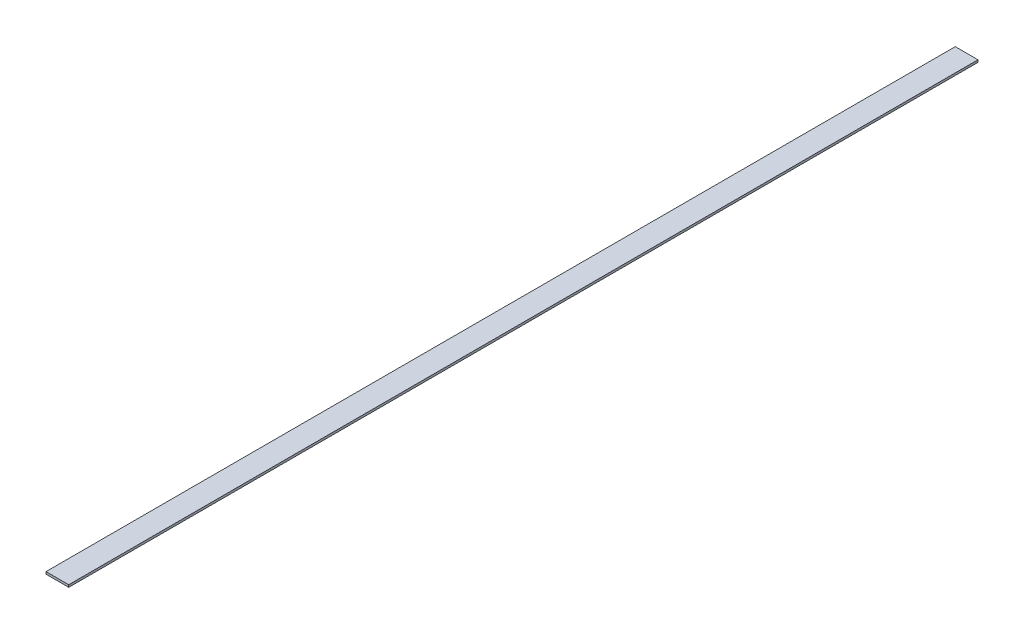
ISO-10303-21;
HEADER;
FILE_DESCRIPTION(('STEP AP214'),'2;1');
FILE_NAME('part.step','',(''),(''),'','','');
FILE_SCHEMA(('AUTOMOTIVE_DESIGN { 1 0 10303 214 1 1 1 1 }'));
ENDSEC;
DATA;
#1=APPLICATION_CONTEXT('core data for automotive mechanical design processes');
#2=APPLICATION_PROTOCOL_DEFINITION('international standard','automotive_design',2000,#1);
#3=PRODUCT_CONTEXT('',#1,'mechanical');
#4=PRODUCT('Part','Part','',(#3));
#5=PRODUCT_RELATED_PRODUCT_CATEGORY('part','',(#4));
#6=PRODUCT_DEFINITION_FORMATION('','',#4);
#7=PRODUCT_DEFINITION_CONTEXT('part definition',#1,'design');
#8=PRODUCT_DEFINITION('design','',#6,#7);
#9=PRODUCT_DEFINITION_SHAPE('','',#8);
#10=(LENGTH_UNIT() NAMED_UNIT(*) SI_UNIT(.MILLI.,.METRE.));
#11=(NAMED_UNIT(*) PLANE_ANGLE_UNIT() SI_UNIT($,.RADIAN.));
#12=(NAMED_UNIT(*) SI_UNIT($,.STERADIAN.) SOLID_ANGLE_UNIT());
#13=UNCERTAINTY_MEASURE_WITH_UNIT(LENGTH_MEASURE(1.E-05),#10,'distance_accuracy_value','');
#14=(GEOMETRIC_REPRESENTATION_CONTEXT(3) GLOBAL_UNCERTAINTY_ASSIGNED_CONTEXT((#13)) GLOBAL_UNIT_ASSIGNED_CONTEXT((#10,
#11,#12)) REPRESENTATION_CONTEXT('',''));
#15=CARTESIAN_POINT('',(0.,0.,0.));
#16=DIRECTION('',(0.,0.,1.));
#17=DIRECTION('',(1.,0.,0.));
#18=AXIS2_PLACEMENT_3D('',#15,#16,#17);
#19=CARTESIAN_POINT('',(15.,1.5,1200.));
#20=DIRECTION('',(-1.,0.,0.));
#21=DIRECTION('',(0.,-1.,0.));
#22=AXIS2_PLACEMENT_3D('',#19,#20,#21);
#23=PLANE('',#22);
#24=DIRECTION('',(0.,1.,0.));
#25=VECTOR('',#24,1.);
#26=CARTESIAN_POINT('',(15.,1.5,0.));
#27=LINE('',#26,#25);
#28=CARTESIAN_POINT('',(15.,-1.5,0.));
#29=VERTEX_POINT('',#28);
#30=CARTESIAN_POINT('',(15.,1.5,0.));
#31=VERTEX_POINT('',#30);
#32=EDGE_CURVE('E111',#29,#31,#27,.T.);
#33=ORIENTED_EDGE('',*,*,#32,.T.);
#34=DIRECTION('',(0.,0.,-1.));
#35=VECTOR('',#34,1.);
#36=CARTESIAN_POINT('',(15.,1.5,1200.));
#37=LINE('',#36,#35);
#38=CARTESIAN_POINT('',(15.,1.5,1200.));
#39=VERTEX_POINT('',#38);
#40=EDGE_CURVE('E11',#39,#31,#37,.T.);
#41=ORIENTED_EDGE('',*,*,#40,.F.);
#42=DIRECTION('',(0.,1.,0.));
#43=VECTOR('',#42,1.);
#44=CARTESIAN_POINT('',(15.,1.5,1200.));
#45=LINE('',#44,#43);
#46=CARTESIAN_POINT('',(15.,-1.5,1200.));
#47=VERTEX_POINT('',#46);
#48=EDGE_CURVE('E95',#47,#39,#45,.T.);
#49=ORIENTED_EDGE('',*,*,#48,.F.);
#50=DIRECTION('',(0.,0.,-1.));
#51=VECTOR('',#50,1.);
#52=CARTESIAN_POINT('',(15.,-1.5,1200.));
#53=LINE('',#52,#51);
#54=EDGE_CURVE('E107',#47,#29,#53,.T.);
#55=ORIENTED_EDGE('',*,*,#54,.T.);
#56=EDGE_LOOP('',(#33,#41,#49,#55));
#57=FACE_BOUND('',#56,.T.);
#58=ADVANCED_FACE('F43',(#57),#23,.F.);
#59=CARTESIAN_POINT('',(-15.,1.5,1200.));
#60=DIRECTION('',(0.,-1.,0.));
#61=DIRECTION('',(0.,0.,-1.));
#62=AXIS2_PLACEMENT_3D('',#59,#60,#61);
#63=PLANE('',#62);
#64=DIRECTION('',(-1.,0.,0.));
#65=VECTOR('',#64,1.);
#66=CARTESIAN_POINT('',(-15.,1.5,0.));
#67=LINE('',#66,#65);
#68=CARTESIAN_POINT('',(-15.,1.5,0.));
#69=VERTEX_POINT('',#68);
#70=EDGE_CURVE('E100',#31,#69,#67,.T.);
#71=ORIENTED_EDGE('',*,*,#70,.T.);
#72=DIRECTION('',(0.,0.,-1.));
#73=VECTOR('',#72,1.);
#74=CARTESIAN_POINT('',(-15.,1.5,1200.));
#75=LINE('',#74,#73);
#76=CARTESIAN_POINT('',(-15.,1.5,1200.));
#77=VERTEX_POINT('',#76);
#78=EDGE_CURVE('E52',#77,#69,#75,.T.);
#79=ORIENTED_EDGE('',*,*,#78,.F.);
#80=DIRECTION('',(-1.,0.,0.));
#81=VECTOR('',#80,1.);
#82=CARTESIAN_POINT('',(-15.,1.5,1200.));
#83=LINE('',#82,#81);
#84=EDGE_CURVE('E90',#39,#77,#83,.T.);
#85=ORIENTED_EDGE('',*,*,#84,.F.);
#86=ORIENTED_EDGE('',*,*,#40,.T.);
#87=EDGE_LOOP('',(#71,#79,#85,#86));
#88=FACE_BOUND('',#87,.T.);
#89=ADVANCED_FACE('F99',(#88),#63,.F.);
#90=CARTESIAN_POINT('',(-15.,1.5,1200.));
#91=DIRECTION('',(1.,0.,0.));
#92=DIRECTION('',(0.,0.,-1.));
#93=AXIS2_PLACEMENT_3D('',#90,#91,#92);
#94=PLANE('',#93);
#95=DIRECTION('',(0.,-1.,0.));
#96=VECTOR('',#95,1.);
#97=CARTESIAN_POINT('',(-15.,1.5,0.));
#98=LINE('',#97,#96);
#99=CARTESIAN_POINT('',(-15.,-1.5,0.));
#100=VERTEX_POINT('',#99);
#101=EDGE_CURVE('E77',#69,#100,#98,.T.);
#102=ORIENTED_EDGE('',*,*,#101,.T.);
#103=DIRECTION('',(0.,0.,-1.));
#104=VECTOR('',#103,1.);
#105=CARTESIAN_POINT('',(-15.,-1.5,1200.));
#106=LINE('',#105,#104);
#107=CARTESIAN_POINT('',(-15.,-1.5,1200.));
#108=VERTEX_POINT('',#107);
#109=EDGE_CURVE('E102',#108,#100,#106,.T.);
#110=ORIENTED_EDGE('',*,*,#109,.F.);
#111=DIRECTION('',(0.,-1.,0.));
#112=VECTOR('',#111,1.);
#113=CARTESIAN_POINT('',(-15.,1.5,1200.));
#114=LINE('',#113,#112);
#115=EDGE_CURVE('E93',#77,#108,#114,.T.);
#116=ORIENTED_EDGE('',*,*,#115,.F.);
#117=ORIENTED_EDGE('',*,*,#78,.T.);
#118=EDGE_LOOP('',(#102,#110,#116,#117));
#119=FACE_BOUND('',#118,.T.);
#120=ADVANCED_FACE('F103',(#119),#94,.F.);
#121=CARTESIAN_POINT('',(-15.,-1.5,1200.));
#122=DIRECTION('',(0.,1.,0.));
#123=DIRECTION('',(0.,0.,1.));
#124=AXIS2_PLACEMENT_3D('',#121,#122,#123);
#125=PLANE('',#124);
#126=DIRECTION('',(1.,0.,0.));
#127=VECTOR('',#126,1.);
#128=CARTESIAN_POINT('',(-15.,-1.5,0.));
#129=LINE('',#128,#127);
#130=EDGE_CURVE('E83',#100,#29,#129,.T.);
#131=ORIENTED_EDGE('',*,*,#130,.T.);
#132=ORIENTED_EDGE('',*,*,#54,.F.);
#133=DIRECTION('',(1.,0.,0.));
#134=VECTOR('',#133,1.);
#135=CARTESIAN_POINT('',(-15.,-1.5,1200.));
#136=LINE('',#135,#134);
#137=EDGE_CURVE('E60',#108,#47,#136,.T.);
#138=ORIENTED_EDGE('',*,*,#137,.F.);
#139=ORIENTED_EDGE('',*,*,#109,.T.);
#140=EDGE_LOOP('',(#131,#132,#138,#139));
#141=FACE_BOUND('',#140,.T.);
#142=ADVANCED_FACE('F124',(#141),#125,.F.);
#143=CARTESIAN_POINT('',(0.,0.,1200.));
#144=DIRECTION('',(0.,0.,1.));
#145=DIRECTION('',(1.,0.,0.));
#146=AXIS2_PLACEMENT_3D('',#143,#144,#145);
#147=PLANE('',#146);
#148=ORIENTED_EDGE('',*,*,#48,.T.);
#149=ORIENTED_EDGE('',*,*,#84,.T.);
#150=ORIENTED_EDGE('',*,*,#115,.T.);
#151=ORIENTED_EDGE('',*,*,#137,.T.);
#152=EDGE_LOOP('',(#148,#149,#150,#151));
#153=FACE_BOUND('',#152,.T.);
#154=ADVANCED_FACE('F91',(#153),#147,.T.);
#155=CARTESIAN_POINT('',(0.,0.,0.));
#156=DIRECTION('',(0.,0.,1.));
#157=DIRECTION('',(1.,0.,0.));
#158=AXIS2_PLACEMENT_3D('',#155,#156,#157);
#159=PLANE('',#158);
#160=ORIENTED_EDGE('',*,*,#32,.F.);
#161=ORIENTED_EDGE('',*,*,#130,.F.);
#162=ORIENTED_EDGE('',*,*,#101,.F.);
#163=ORIENTED_EDGE('',*,*,#70,.F.);
#164=EDGE_LOOP('',(#160,#161,#162,#163));
#165=FACE_BOUND('',#164,.T.);
#166=ADVANCED_FACE('F127',(#165),#159,.F.);
#167=CLOSED_SHELL('',(#58,#89,#120,#142,#154,#166));
#168=MANIFOLD_SOLID_BREP('B2',#167);
#169=ADVANCED_BREP_SHAPE_REPRESENTATION('',(#18,#168),#14);
#170=SHAPE_DEFINITION_REPRESENTATION(#9,#169);
ENDSEC;
END-ISO-10303-21;
